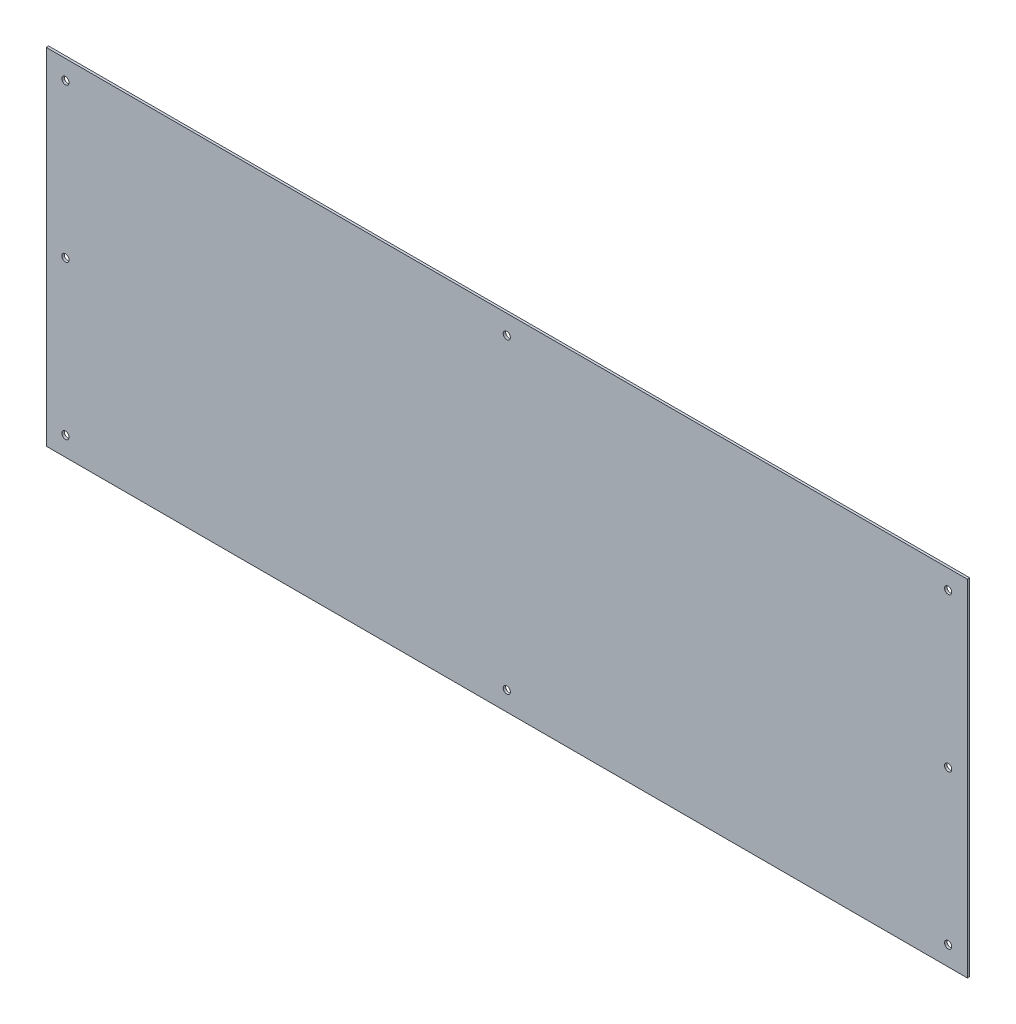
ISO-10303-21;
HEADER;
FILE_DESCRIPTION(('STEP AP214'),'2;1');
FILE_NAME('part.step','',(''),(''),'','','');
FILE_SCHEMA(('AUTOMOTIVE_DESIGN { 1 0 10303 214 1 1 1 1 }'));
ENDSEC;
DATA;
#1=APPLICATION_CONTEXT('core data for automotive mechanical design processes');
#2=APPLICATION_PROTOCOL_DEFINITION('international standard','automotive_design',2000,#1);
#3=PRODUCT_CONTEXT('',#1,'mechanical');
#4=PRODUCT('Part','Part','',(#3));
#5=PRODUCT_RELATED_PRODUCT_CATEGORY('part','',(#4));
#6=PRODUCT_DEFINITION_FORMATION('','',#4);
#7=PRODUCT_DEFINITION_CONTEXT('part definition',#1,'design');
#8=PRODUCT_DEFINITION('design','',#6,#7);
#9=PRODUCT_DEFINITION_SHAPE('','',#8);
#10=(LENGTH_UNIT() NAMED_UNIT(*) SI_UNIT(.MILLI.,.METRE.));
#11=(NAMED_UNIT(*) PLANE_ANGLE_UNIT() SI_UNIT($,.RADIAN.));
#12=(NAMED_UNIT(*) SI_UNIT($,.STERADIAN.) SOLID_ANGLE_UNIT());
#13=UNCERTAINTY_MEASURE_WITH_UNIT(LENGTH_MEASURE(1.E-05),#10,'distance_accuracy_value','');
#14=(GEOMETRIC_REPRESENTATION_CONTEXT(3) GLOBAL_UNCERTAINTY_ASSIGNED_CONTEXT((#13)) GLOBAL_UNIT_ASSIGNED_CONTEXT((#10,
#11,#12)) REPRESENTATION_CONTEXT('',''));
#15=CARTESIAN_POINT('',(0.,0.,0.));
#16=DIRECTION('',(0.,0.,1.));
#17=DIRECTION('',(1.,0.,0.));
#18=AXIS2_PLACEMENT_3D('',#15,#16,#17);
#19=CARTESIAN_POINT('',(0.,0.,3.175));
#20=DIRECTION('',(0.,0.,1.));
#21=DIRECTION('',(1.,0.,0.));
#22=AXIS2_PLACEMENT_3D('',#19,#20,#21);
#23=PLANE('',#22);
#24=CARTESIAN_POINT('',(584.2,203.2,3.175));
#25=DIRECTION('',(0.,0.,1.));
#26=DIRECTION('',(1.,0.,0.));
#27=AXIS2_PLACEMENT_3D('',#24,#25,#26);
#28=CIRCLE('',#27,4.7625);
#29=CARTESIAN_POINT('',(588.9625,203.2,3.175));
#30=VERTEX_POINT('',#29);
#31=EDGE_CURVE('E104',#30,#30,#28,.F.);
#32=ORIENTED_EDGE('',*,*,#31,.T.);
#33=EDGE_LOOP('',(#32));
#34=FACE_BOUND('',#33,.T.);
#35=CARTESIAN_POINT('',(584.2,0.,3.175));
#36=DIRECTION('',(0.,0.,1.));
#37=DIRECTION('',(1.,0.,0.));
#38=AXIS2_PLACEMENT_3D('',#35,#36,#37);
#39=CIRCLE('',#38,4.7625);
#40=CARTESIAN_POINT('',(588.9625,0.,3.175));
#41=VERTEX_POINT('',#40);
#42=EDGE_CURVE('E107',#41,#41,#39,.F.);
#43=ORIENTED_EDGE('',*,*,#42,.T.);
#44=EDGE_LOOP('',(#43));
#45=FACE_BOUND('',#44,.T.);
#46=CARTESIAN_POINT('',(584.2,-203.2,3.175));
#47=DIRECTION('',(0.,0.,1.));
#48=DIRECTION('',(1.,0.,0.));
#49=AXIS2_PLACEMENT_3D('',#46,#47,#48);
#50=CIRCLE('',#49,4.7625);
#51=CARTESIAN_POINT('',(588.9625,-203.2,3.175));
#52=VERTEX_POINT('',#51);
#53=EDGE_CURVE('E110',#52,#52,#50,.F.);
#54=ORIENTED_EDGE('',*,*,#53,.T.);
#55=EDGE_LOOP('',(#54));
#56=FACE_BOUND('',#55,.T.);
#57=CARTESIAN_POINT('',(0.,-203.2,3.175));
#58=DIRECTION('',(0.,0.,1.));
#59=DIRECTION('',(1.,0.,0.));
#60=AXIS2_PLACEMENT_3D('',#57,#58,#59);
#61=CIRCLE('',#60,4.7625);
#62=CARTESIAN_POINT('',(4.7625,-203.2,3.175));
#63=VERTEX_POINT('',#62);
#64=EDGE_CURVE('E113',#63,#63,#61,.F.);
#65=ORIENTED_EDGE('',*,*,#64,.T.);
#66=EDGE_LOOP('',(#65));
#67=FACE_BOUND('',#66,.T.);
#68=CARTESIAN_POINT('',(0.,203.2,3.175));
#69=DIRECTION('',(0.,0.,-1.));
#70=DIRECTION('',(-1.,0.,0.));
#71=AXIS2_PLACEMENT_3D('',#68,#69,#70);
#72=CIRCLE('',#71,4.7625);
#73=CARTESIAN_POINT('',(-4.7625,203.2,3.175));
#74=VERTEX_POINT('',#73);
#75=EDGE_CURVE('E116',#74,#74,#72,.T.);
#76=ORIENTED_EDGE('',*,*,#75,.T.);
#77=EDGE_LOOP('',(#76));
#78=FACE_BOUND('',#77,.T.);
#79=CARTESIAN_POINT('',(-584.2,203.2,3.175));
#80=DIRECTION('',(0.,0.,-1.));
#81=DIRECTION('',(-1.,0.,0.));
#82=AXIS2_PLACEMENT_3D('',#79,#80,#81);
#83=CIRCLE('',#82,4.7625);
#84=CARTESIAN_POINT('',(-588.9625,203.2,3.175));
#85=VERTEX_POINT('',#84);
#86=EDGE_CURVE('E119',#85,#85,#83,.T.);
#87=ORIENTED_EDGE('',*,*,#86,.T.);
#88=EDGE_LOOP('',(#87));
#89=FACE_BOUND('',#88,.T.);
#90=CARTESIAN_POINT('',(-584.2,0.,3.175));
#91=DIRECTION('',(0.,0.,-1.));
#92=DIRECTION('',(-1.,0.,0.));
#93=AXIS2_PLACEMENT_3D('',#90,#91,#92);
#94=CIRCLE('',#93,4.7625);
#95=CARTESIAN_POINT('',(-588.9625,0.,3.175));
#96=VERTEX_POINT('',#95);
#97=EDGE_CURVE('E121',#96,#96,#94,.T.);
#98=ORIENTED_EDGE('',*,*,#97,.T.);
#99=EDGE_LOOP('',(#98));
#100=FACE_BOUND('',#99,.T.);
#101=CARTESIAN_POINT('',(-584.2,-203.2,3.175));
#102=DIRECTION('',(0.,0.,-1.));
#103=DIRECTION('',(-1.,0.,0.));
#104=AXIS2_PLACEMENT_3D('',#101,#102,#103);
#105=CIRCLE('',#104,4.7625);
#106=CARTESIAN_POINT('',(-588.9625,-203.2,3.175));
#107=VERTEX_POINT('',#106);
#108=EDGE_CURVE('E20',#107,#107,#105,.T.);
#109=ORIENTED_EDGE('',*,*,#108,.T.);
#110=EDGE_LOOP('',(#109));
#111=FACE_BOUND('',#110,.T.);
#112=DIRECTION('',(1.,0.,0.));
#113=VECTOR('',#112,1.);
#114=CARTESIAN_POINT('',(609.6,228.6,3.175));
#115=LINE('',#114,#113);
#116=CARTESIAN_POINT('',(-609.6,228.6,3.175));
#117=VERTEX_POINT('',#116);
#118=CARTESIAN_POINT('',(609.6,228.6,3.175));
#119=VERTEX_POINT('',#118);
#120=EDGE_CURVE('E71',#117,#119,#115,.T.);
#121=ORIENTED_EDGE('',*,*,#120,.F.);
#122=DIRECTION('',(0.,1.,0.));
#123=VECTOR('',#122,1.);
#124=CARTESIAN_POINT('',(-609.6,228.6,3.175));
#125=LINE('',#124,#123);
#126=CARTESIAN_POINT('',(-609.6,-228.6,3.175));
#127=VERTEX_POINT('',#126);
#128=EDGE_CURVE('E68',#127,#117,#125,.T.);
#129=ORIENTED_EDGE('',*,*,#128,.F.);
#130=DIRECTION('',(1.,0.,0.));
#131=VECTOR('',#130,1.);
#132=CARTESIAN_POINT('',(-609.6,-228.6,3.175));
#133=LINE('',#132,#131);
#134=CARTESIAN_POINT('',(609.6,-228.6,3.175));
#135=VERTEX_POINT('',#134);
#136=EDGE_CURVE('E59',#135,#127,#133,.F.);
#137=ORIENTED_EDGE('',*,*,#136,.F.);
#138=DIRECTION('',(0.,1.,0.));
#139=VECTOR('',#138,1.);
#140=CARTESIAN_POINT('',(609.6,-228.6,3.175));
#141=LINE('',#140,#139);
#142=EDGE_CURVE('E54',#119,#135,#141,.F.);
#143=ORIENTED_EDGE('',*,*,#142,.F.);
#144=EDGE_LOOP('',(#121,#129,#137,#143));
#145=FACE_BOUND('',#144,.T.);
#146=ADVANCED_FACE('F17',(#34,#45,#56,#67,#78,#89,#100,#111,#145),#23,.T.);
#147=CARTESIAN_POINT('',(-609.6,228.6,0.));
#148=DIRECTION('',(-1.,0.,0.));
#149=DIRECTION('',(0.,0.,1.));
#150=AXIS2_PLACEMENT_3D('',#147,#148,#149);
#151=PLANE('',#150);
#152=DIRECTION('',(0.,0.,1.));
#153=VECTOR('',#152,1.);
#154=CARTESIAN_POINT('',(-609.6,228.6,0.));
#155=LINE('',#154,#153);
#156=CARTESIAN_POINT('',(-609.6,228.6,0.));
#157=VERTEX_POINT('',#156);
#158=EDGE_CURVE('E129',#157,#117,#155,.T.);
#159=ORIENTED_EDGE('',*,*,#158,.F.);
#160=DIRECTION('',(0.,1.,0.));
#161=VECTOR('',#160,1.);
#162=CARTESIAN_POINT('',(-609.6,0.,0.));
#163=LINE('',#162,#161);
#164=CARTESIAN_POINT('',(-609.6,-228.6,0.));
#165=VERTEX_POINT('',#164);
#166=EDGE_CURVE('E78',#157,#165,#163,.F.);
#167=ORIENTED_EDGE('',*,*,#166,.T.);
#168=DIRECTION('',(0.,0.,-1.));
#169=VECTOR('',#168,1.);
#170=CARTESIAN_POINT('',(-609.6,-228.6,0.));
#171=LINE('',#170,#169);
#172=EDGE_CURVE('E64',#127,#165,#171,.T.);
#173=ORIENTED_EDGE('',*,*,#172,.F.);
#174=ORIENTED_EDGE('',*,*,#128,.T.);
#175=EDGE_LOOP('',(#159,#167,#173,#174));
#176=FACE_BOUND('',#175,.T.);
#177=ADVANCED_FACE('F77',(#176),#151,.T.);
#178=CARTESIAN_POINT('',(-609.6,-228.6,0.));
#179=DIRECTION('',(0.,-1.,0.));
#180=DIRECTION('',(0.,0.,-1.));
#181=AXIS2_PLACEMENT_3D('',#178,#179,#180);
#182=PLANE('',#181);
#183=ORIENTED_EDGE('',*,*,#172,.T.);
#184=DIRECTION('',(1.,0.,0.));
#185=VECTOR('',#184,1.);
#186=CARTESIAN_POINT('',(0.,-228.6,0.));
#187=LINE('',#186,#185);
#188=CARTESIAN_POINT('',(609.6,-228.6,0.));
#189=VERTEX_POINT('',#188);
#190=EDGE_CURVE('E140',#165,#189,#187,.T.);
#191=ORIENTED_EDGE('',*,*,#190,.T.);
#192=DIRECTION('',(0.,0.,-1.));
#193=VECTOR('',#192,1.);
#194=CARTESIAN_POINT('',(609.6,-228.6,0.));
#195=LINE('',#194,#193);
#196=EDGE_CURVE('E66',#135,#189,#195,.T.);
#197=ORIENTED_EDGE('',*,*,#196,.F.);
#198=ORIENTED_EDGE('',*,*,#136,.T.);
#199=EDGE_LOOP('',(#183,#191,#197,#198));
#200=FACE_BOUND('',#199,.T.);
#201=ADVANCED_FACE('F61',(#200),#182,.T.);
#202=CARTESIAN_POINT('',(609.6,-228.6,0.));
#203=DIRECTION('',(1.,0.,0.));
#204=DIRECTION('',(0.,0.,-1.));
#205=AXIS2_PLACEMENT_3D('',#202,#203,#204);
#206=PLANE('',#205);
#207=ORIENTED_EDGE('',*,*,#196,.T.);
#208=DIRECTION('',(0.,1.,0.));
#209=VECTOR('',#208,1.);
#210=CARTESIAN_POINT('',(609.6,0.,0.));
#211=LINE('',#210,#209);
#212=CARTESIAN_POINT('',(609.6,228.6,0.));
#213=VERTEX_POINT('',#212);
#214=EDGE_CURVE('E137',#189,#213,#211,.T.);
#215=ORIENTED_EDGE('',*,*,#214,.T.);
#216=DIRECTION('',(0.,0.,1.));
#217=VECTOR('',#216,1.);
#218=CARTESIAN_POINT('',(609.6,228.6,0.));
#219=LINE('',#218,#217);
#220=EDGE_CURVE('E35',#119,#213,#219,.F.);
#221=ORIENTED_EDGE('',*,*,#220,.F.);
#222=ORIENTED_EDGE('',*,*,#142,.T.);
#223=EDGE_LOOP('',(#207,#215,#221,#222));
#224=FACE_BOUND('',#223,.T.);
#225=ADVANCED_FACE('F136',(#224),#206,.T.);
#226=CARTESIAN_POINT('',(609.6,228.6,0.));
#227=DIRECTION('',(0.,1.,0.));
#228=DIRECTION('',(0.,0.,1.));
#229=AXIS2_PLACEMENT_3D('',#226,#227,#228);
#230=PLANE('',#229);
#231=ORIENTED_EDGE('',*,*,#220,.T.);
#232=DIRECTION('',(1.,0.,0.));
#233=VECTOR('',#232,1.);
#234=CARTESIAN_POINT('',(0.,228.6,0.));
#235=LINE('',#234,#233);
#236=EDGE_CURVE('E103',#213,#157,#235,.F.);
#237=ORIENTED_EDGE('',*,*,#236,.T.);
#238=ORIENTED_EDGE('',*,*,#158,.T.);
#239=ORIENTED_EDGE('',*,*,#120,.T.);
#240=EDGE_LOOP('',(#231,#237,#238,#239));
#241=FACE_BOUND('',#240,.T.);
#242=ADVANCED_FACE('F143',(#241),#230,.T.);
#243=CARTESIAN_POINT('',(-584.2,-203.2,3.175));
#244=DIRECTION('',(0.,0.,-1.));
#245=DIRECTION('',(-1.,0.,0.));
#246=AXIS2_PLACEMENT_3D('',#243,#244,#245);
#247=CYLINDRICAL_SURFACE('',#246,4.7625);
#248=ORIENTED_EDGE('',*,*,#108,.F.);
#249=EDGE_LOOP('',(#248));
#250=FACE_BOUND('',#249,.T.);
#251=CARTESIAN_POINT('',(-584.2,-203.2,0.));
#252=DIRECTION('',(0.,0.,-1.));
#253=DIRECTION('',(-1.,0.,0.));
#254=AXIS2_PLACEMENT_3D('',#251,#252,#253);
#255=CIRCLE('',#254,4.7625);
#256=CARTESIAN_POINT('',(-588.9625,-203.2,0.));
#257=VERTEX_POINT('',#256);
#258=EDGE_CURVE('E100',#257,#257,#255,.T.);
#259=ORIENTED_EDGE('',*,*,#258,.T.);
#260=EDGE_LOOP('',(#259));
#261=FACE_BOUND('',#260,.T.);
#262=ADVANCED_FACE('F145',(#250,#261),#247,.F.);
#263=CARTESIAN_POINT('',(-584.2,0.,3.175));
#264=DIRECTION('',(0.,0.,-1.));
#265=DIRECTION('',(-1.,0.,0.));
#266=AXIS2_PLACEMENT_3D('',#263,#264,#265);
#267=CYLINDRICAL_SURFACE('',#266,4.7625);
#268=ORIENTED_EDGE('',*,*,#97,.F.);
#269=EDGE_LOOP('',(#268));
#270=FACE_BOUND('',#269,.T.);
#271=CARTESIAN_POINT('',(-584.2,0.,0.));
#272=DIRECTION('',(0.,0.,-1.));
#273=DIRECTION('',(-1.,0.,0.));
#274=AXIS2_PLACEMENT_3D('',#271,#272,#273);
#275=CIRCLE('',#274,4.7625);
#276=CARTESIAN_POINT('',(-588.9625,0.,0.));
#277=VERTEX_POINT('',#276);
#278=EDGE_CURVE('E97',#277,#277,#275,.T.);
#279=ORIENTED_EDGE('',*,*,#278,.T.);
#280=EDGE_LOOP('',(#279));
#281=FACE_BOUND('',#280,.T.);
#282=ADVANCED_FACE('F152',(#270,#281),#267,.F.);
#283=CARTESIAN_POINT('',(-584.2,203.2,3.175));
#284=DIRECTION('',(0.,0.,-1.));
#285=DIRECTION('',(-1.,0.,0.));
#286=AXIS2_PLACEMENT_3D('',#283,#284,#285);
#287=CYLINDRICAL_SURFACE('',#286,4.7625);
#288=ORIENTED_EDGE('',*,*,#86,.F.);
#289=EDGE_LOOP('',(#288));
#290=FACE_BOUND('',#289,.T.);
#291=CARTESIAN_POINT('',(-584.2,203.2,0.));
#292=DIRECTION('',(0.,0.,-1.));
#293=DIRECTION('',(-1.,0.,0.));
#294=AXIS2_PLACEMENT_3D('',#291,#292,#293);
#295=CIRCLE('',#294,4.7625);
#296=CARTESIAN_POINT('',(-588.9625,203.2,0.));
#297=VERTEX_POINT('',#296);
#298=EDGE_CURVE('E94',#297,#297,#295,.T.);
#299=ORIENTED_EDGE('',*,*,#298,.T.);
#300=EDGE_LOOP('',(#299));
#301=FACE_BOUND('',#300,.T.);
#302=ADVANCED_FACE('F183',(#290,#301),#287,.F.);
#303=CARTESIAN_POINT('',(0.,203.2,3.175));
#304=DIRECTION('',(0.,0.,-1.));
#305=DIRECTION('',(-1.,0.,0.));
#306=AXIS2_PLACEMENT_3D('',#303,#304,#305);
#307=CYLINDRICAL_SURFACE('',#306,4.7625);
#308=ORIENTED_EDGE('',*,*,#75,.F.);
#309=EDGE_LOOP('',(#308));
#310=FACE_BOUND('',#309,.T.);
#311=CARTESIAN_POINT('',(0.,203.2,0.));
#312=DIRECTION('',(0.,0.,-1.));
#313=DIRECTION('',(-1.,0.,0.));
#314=AXIS2_PLACEMENT_3D('',#311,#312,#313);
#315=CIRCLE('',#314,4.7625);
#316=CARTESIAN_POINT('',(-4.7625,203.2,0.));
#317=VERTEX_POINT('',#316);
#318=EDGE_CURVE('E91',#317,#317,#315,.T.);
#319=ORIENTED_EDGE('',*,*,#318,.T.);
#320=EDGE_LOOP('',(#319));
#321=FACE_BOUND('',#320,.T.);
#322=ADVANCED_FACE('F179',(#310,#321),#307,.F.);
#323=CARTESIAN_POINT('',(0.,-203.2,3.175));
#324=DIRECTION('',(0.,0.,1.));
#325=DIRECTION('',(1.,0.,0.));
#326=AXIS2_PLACEMENT_3D('',#323,#324,#325);
#327=CYLINDRICAL_SURFACE('',#326,4.7625);
#328=ORIENTED_EDGE('',*,*,#64,.F.);
#329=EDGE_LOOP('',(#328));
#330=FACE_BOUND('',#329,.T.);
#331=CARTESIAN_POINT('',(0.,-203.2,0.));
#332=DIRECTION('',(0.,0.,1.));
#333=DIRECTION('',(1.,0.,0.));
#334=AXIS2_PLACEMENT_3D('',#331,#332,#333);
#335=CIRCLE('',#334,4.7625);
#336=CARTESIAN_POINT('',(4.7625,-203.2,0.));
#337=VERTEX_POINT('',#336);
#338=EDGE_CURVE('E88',#337,#337,#335,.F.);
#339=ORIENTED_EDGE('',*,*,#338,.T.);
#340=EDGE_LOOP('',(#339));
#341=FACE_BOUND('',#340,.T.);
#342=ADVANCED_FACE('F175',(#330,#341),#327,.F.);
#343=CARTESIAN_POINT('',(584.2,-203.2,3.175));
#344=DIRECTION('',(0.,0.,1.));
#345=DIRECTION('',(1.,0.,0.));
#346=AXIS2_PLACEMENT_3D('',#343,#344,#345);
#347=CYLINDRICAL_SURFACE('',#346,4.7625);
#348=ORIENTED_EDGE('',*,*,#53,.F.);
#349=EDGE_LOOP('',(#348));
#350=FACE_BOUND('',#349,.T.);
#351=CARTESIAN_POINT('',(584.2,-203.2,0.));
#352=DIRECTION('',(0.,0.,1.));
#353=DIRECTION('',(1.,0.,0.));
#354=AXIS2_PLACEMENT_3D('',#351,#352,#353);
#355=CIRCLE('',#354,4.7625);
#356=CARTESIAN_POINT('',(588.9625,-203.2,0.));
#357=VERTEX_POINT('',#356);
#358=EDGE_CURVE('E85',#357,#357,#355,.F.);
#359=ORIENTED_EDGE('',*,*,#358,.T.);
#360=EDGE_LOOP('',(#359));
#361=FACE_BOUND('',#360,.T.);
#362=ADVANCED_FACE('F171',(#350,#361),#347,.F.);
#363=CARTESIAN_POINT('',(584.2,0.,3.175));
#364=DIRECTION('',(0.,0.,1.));
#365=DIRECTION('',(1.,0.,0.));
#366=AXIS2_PLACEMENT_3D('',#363,#364,#365);
#367=CYLINDRICAL_SURFACE('',#366,4.7625);
#368=ORIENTED_EDGE('',*,*,#42,.F.);
#369=EDGE_LOOP('',(#368));
#370=FACE_BOUND('',#369,.T.);
#371=CARTESIAN_POINT('',(584.2,0.,0.));
#372=DIRECTION('',(0.,0.,1.));
#373=DIRECTION('',(1.,0.,0.));
#374=AXIS2_PLACEMENT_3D('',#371,#372,#373);
#375=CIRCLE('',#374,4.7625);
#376=CARTESIAN_POINT('',(588.9625,0.,0.));
#377=VERTEX_POINT('',#376);
#378=EDGE_CURVE('E26',#377,#377,#375,.F.);
#379=ORIENTED_EDGE('',*,*,#378,.T.);
#380=EDGE_LOOP('',(#379));
#381=FACE_BOUND('',#380,.T.);
#382=ADVANCED_FACE('F163',(#370,#381),#367,.F.);
#383=CARTESIAN_POINT('',(584.2,203.2,3.175));
#384=DIRECTION('',(0.,0.,1.));
#385=DIRECTION('',(1.,0.,0.));
#386=AXIS2_PLACEMENT_3D('',#383,#384,#385);
#387=CYLINDRICAL_SURFACE('',#386,4.7625);
#388=ORIENTED_EDGE('',*,*,#31,.F.);
#389=EDGE_LOOP('',(#388));
#390=FACE_BOUND('',#389,.T.);
#391=CARTESIAN_POINT('',(584.2,203.2,0.));
#392=DIRECTION('',(0.,0.,1.));
#393=DIRECTION('',(1.,0.,0.));
#394=AXIS2_PLACEMENT_3D('',#391,#392,#393);
#395=CIRCLE('',#394,4.7625);
#396=CARTESIAN_POINT('',(588.9625,203.2,0.));
#397=VERTEX_POINT('',#396);
#398=EDGE_CURVE('E11',#397,#397,#395,.F.);
#399=ORIENTED_EDGE('',*,*,#398,.T.);
#400=EDGE_LOOP('',(#399));
#401=FACE_BOUND('',#400,.T.);
#402=ADVANCED_FACE('F157',(#390,#401),#387,.F.);
#403=CARTESIAN_POINT('',(0.,0.,0.));
#404=DIRECTION('',(0.,0.,1.));
#405=DIRECTION('',(1.,0.,0.));
#406=AXIS2_PLACEMENT_3D('',#403,#404,#405);
#407=PLANE('',#406);
#408=ORIENTED_EDGE('',*,*,#398,.F.);
#409=EDGE_LOOP('',(#408));
#410=FACE_BOUND('',#409,.T.);
#411=ORIENTED_EDGE('',*,*,#378,.F.);
#412=EDGE_LOOP('',(#411));
#413=FACE_BOUND('',#412,.T.);
#414=ORIENTED_EDGE('',*,*,#358,.F.);
#415=EDGE_LOOP('',(#414));
#416=FACE_BOUND('',#415,.T.);
#417=ORIENTED_EDGE('',*,*,#338,.F.);
#418=EDGE_LOOP('',(#417));
#419=FACE_BOUND('',#418,.T.);
#420=ORIENTED_EDGE('',*,*,#318,.F.);
#421=EDGE_LOOP('',(#420));
#422=FACE_BOUND('',#421,.T.);
#423=ORIENTED_EDGE('',*,*,#298,.F.);
#424=EDGE_LOOP('',(#423));
#425=FACE_BOUND('',#424,.T.);
#426=ORIENTED_EDGE('',*,*,#278,.F.);
#427=EDGE_LOOP('',(#426));
#428=FACE_BOUND('',#427,.T.);
#429=ORIENTED_EDGE('',*,*,#258,.F.);
#430=EDGE_LOOP('',(#429));
#431=FACE_BOUND('',#430,.T.);
#432=ORIENTED_EDGE('',*,*,#214,.F.);
#433=ORIENTED_EDGE('',*,*,#190,.F.);
#434=ORIENTED_EDGE('',*,*,#166,.F.);
#435=ORIENTED_EDGE('',*,*,#236,.F.);
#436=EDGE_LOOP('',(#432,#433,#434,#435));
#437=FACE_BOUND('',#436,.T.);
#438=ADVANCED_FACE('F139',(#410,#413,#416,#419,#422,#425,#428,#431,#437),#407,.F.);
#439=CLOSED_SHELL('',(#146,#177,#201,#225,#242,#262,#282,#302,#322,#342,#362,#382,#402,#438));
#440=MANIFOLD_SOLID_BREP('B1',#439);
#441=ADVANCED_BREP_SHAPE_REPRESENTATION('',(#18,#440),#14);
#442=SHAPE_DEFINITION_REPRESENTATION(#9,#441);
ENDSEC;
END-ISO-10303-21;
